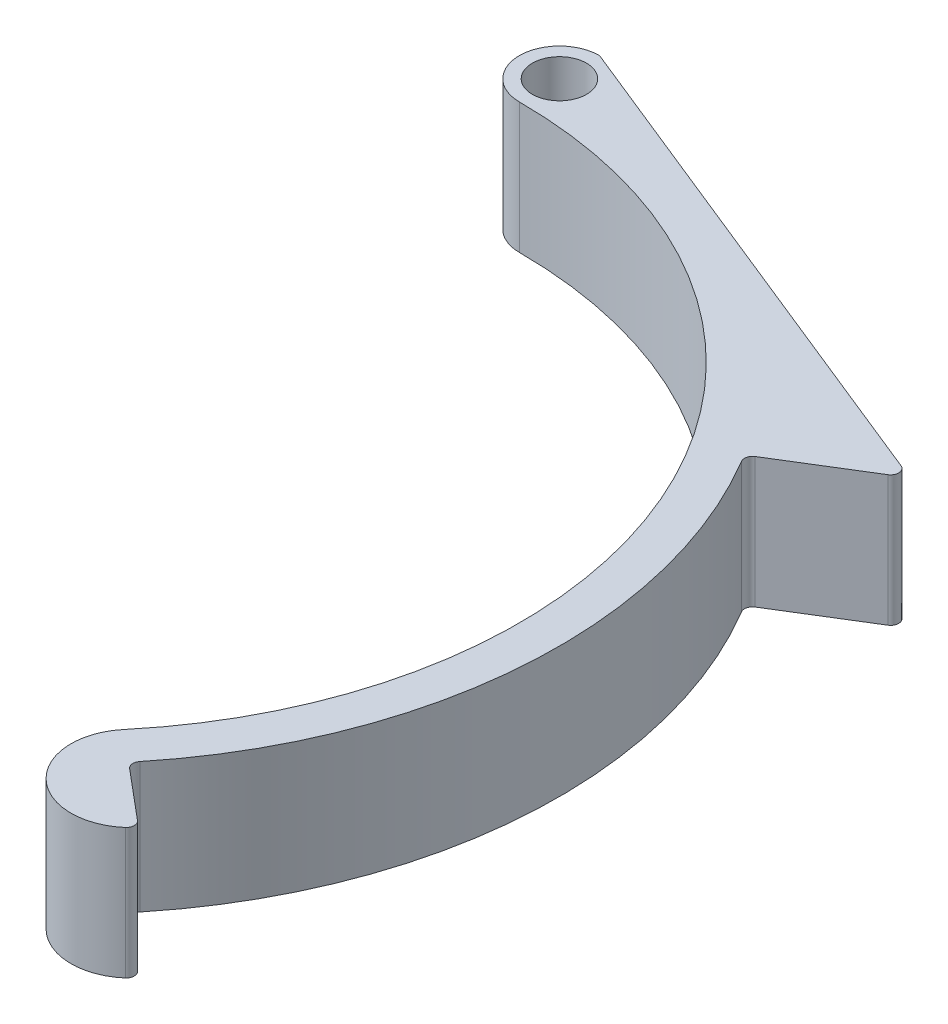
ISO-10303-21;
HEADER;
FILE_DESCRIPTION(('STEP AP214'),'2;1');
FILE_NAME('part.step','',(''),(''),'','','');
FILE_SCHEMA(('AUTOMOTIVE_DESIGN { 1 0 10303 214 1 1 1 1 }'));
ENDSEC;
DATA;
#1=APPLICATION_CONTEXT('core data for automotive mechanical design processes');
#2=APPLICATION_PROTOCOL_DEFINITION('international standard','automotive_design',2000,#1);
#3=PRODUCT_CONTEXT('',#1,'mechanical');
#4=PRODUCT('Part','Part','',(#3));
#5=PRODUCT_RELATED_PRODUCT_CATEGORY('part','',(#4));
#6=PRODUCT_DEFINITION_FORMATION('','',#4);
#7=PRODUCT_DEFINITION_CONTEXT('part definition',#1,'design');
#8=PRODUCT_DEFINITION('design','',#6,#7);
#9=PRODUCT_DEFINITION_SHAPE('','',#8);
#10=(LENGTH_UNIT() NAMED_UNIT(*) SI_UNIT(.MILLI.,.METRE.));
#11=(NAMED_UNIT(*) PLANE_ANGLE_UNIT() SI_UNIT($,.RADIAN.));
#12=(NAMED_UNIT(*) SI_UNIT($,.STERADIAN.) SOLID_ANGLE_UNIT());
#13=UNCERTAINTY_MEASURE_WITH_UNIT(LENGTH_MEASURE(1.E-05),#10,'distance_accuracy_value','');
#14=(GEOMETRIC_REPRESENTATION_CONTEXT(3) GLOBAL_UNCERTAINTY_ASSIGNED_CONTEXT((#13)) GLOBAL_UNIT_ASSIGNED_CONTEXT((#10,
#11,#12)) REPRESENTATION_CONTEXT('',''));
#15=CARTESIAN_POINT('',(0.,0.,0.));
#16=DIRECTION('',(0.,0.,1.));
#17=DIRECTION('',(1.,0.,0.));
#18=AXIS2_PLACEMENT_3D('',#15,#16,#17);
#19=CARTESIAN_POINT('',(0.,13.,0.));
#20=DIRECTION('',(0.,-1.,0.));
#21=DIRECTION('',(0.,0.,-1.));
#22=AXIS2_PLACEMENT_3D('',#19,#20,#21);
#23=CYLINDRICAL_SURFACE('',#22,45.);
#24=CARTESIAN_POINT('',(0.,0.,0.));
#25=DIRECTION('',(0.,1.,0.));
#26=DIRECTION('',(0.,0.,1.));
#27=AXIS2_PLACEMENT_3D('',#24,#25,#26);
#28=CIRCLE('',#27,45.);
#29=CARTESIAN_POINT('',(0.,0.,-45.));
#30=VERTEX_POINT('',#29);
#31=CARTESIAN_POINT('',(34.4719999403541,0.,28.9254424358942));
#32=VERTEX_POINT('',#31);
#33=EDGE_CURVE('E158',#30,#32,#28,.F.);
#34=ORIENTED_EDGE('',*,*,#33,.T.);
#35=DIRECTION('',(0.,-1.,0.));
#36=VECTOR('',#35,1.);
#37=CARTESIAN_POINT('',(34.4719999403541,13.,28.9254424358942));
#38=LINE('',#37,#36);
#39=CARTESIAN_POINT('',(34.4719999403541,13.,28.9254424358942));
#40=VERTEX_POINT('',#39);
#41=EDGE_CURVE('E141',#40,#32,#38,.T.);
#42=ORIENTED_EDGE('',*,*,#41,.F.);
#43=CARTESIAN_POINT('',(0.,13.,0.));
#44=DIRECTION('',(0.,1.,0.));
#45=DIRECTION('',(0.,0.,1.));
#46=AXIS2_PLACEMENT_3D('',#43,#44,#45);
#47=CIRCLE('',#46,45.);
#48=CARTESIAN_POINT('',(0.,13.,-45.));
#49=VERTEX_POINT('',#48);
#50=EDGE_CURVE('E148',#49,#40,#47,.F.);
#51=ORIENTED_EDGE('',*,*,#50,.F.);
#52=DIRECTION('',(0.,-1.,0.));
#53=VECTOR('',#52,1.);
#54=CARTESIAN_POINT('',(0.,13.,-45.));
#55=LINE('',#54,#53);
#56=EDGE_CURVE('E161',#49,#30,#55,.T.);
#57=ORIENTED_EDGE('',*,*,#56,.T.);
#58=EDGE_LOOP('',(#34,#42,#51,#57));
#59=FACE_BOUND('',#58,.T.);
#60=ADVANCED_FACE('F45',(#59),#23,.F.);
#61=CARTESIAN_POINT('',(39.0682665990679,13.,32.7821680940134));
#62=DIRECTION('',(0.,-1.,0.));
#63=DIRECTION('',(0.,0.,-1.));
#64=AXIS2_PLACEMENT_3D('',#61,#62,#63);
#65=CYLINDRICAL_SURFACE('',#64,6.);
#66=CARTESIAN_POINT('',(39.0682665990679,0.,32.7821680940134));
#67=DIRECTION('',(0.,1.,0.));
#68=DIRECTION('',(0.,0.,1.));
#69=AXIS2_PLACEMENT_3D('',#66,#67,#68);
#70=CIRCLE('',#69,6.);
#71=CARTESIAN_POINT('',(43.0164714381837,0.,37.3000966623269));
#72=VERTEX_POINT('',#71);
#73=EDGE_CURVE('E266',#32,#72,#70,.T.);
#74=ORIENTED_EDGE('',*,*,#73,.T.);
#75=DIRECTION('',(0.,-1.,0.));
#76=VECTOR('',#75,1.);
#77=CARTESIAN_POINT('',(43.0164714381837,13.,37.3000966623269));
#78=LINE('',#77,#76);
#79=CARTESIAN_POINT('',(43.0164714381837,13.,37.3000966623269));
#80=VERTEX_POINT('',#79);
#81=EDGE_CURVE('E144',#72,#80,#78,.F.);
#82=ORIENTED_EDGE('',*,*,#81,.T.);
#83=CARTESIAN_POINT('',(39.0682665990679,13.,32.7821680940134));
#84=DIRECTION('',(0.,1.,0.));
#85=DIRECTION('',(0.,0.,1.));
#86=AXIS2_PLACEMENT_3D('',#83,#84,#85);
#87=CIRCLE('',#86,6.);
#88=EDGE_CURVE('E136',#40,#80,#87,.T.);
#89=ORIENTED_EDGE('',*,*,#88,.F.);
#90=ORIENTED_EDGE('',*,*,#41,.T.);
#91=EDGE_LOOP('',(#74,#82,#89,#90));
#92=FACE_BOUND('',#91,.T.);
#93=ADVANCED_FACE('F139',(#92),#65,.T.);
#94=CARTESIAN_POINT('',(0.,13.,0.));
#95=DIRECTION('',(-0.642787609686538,0.,0.766044443118979));
#96=DIRECTION('',(0.766044443118979,0.,0.642787609686538));
#97=AXIS2_PLACEMENT_3D('',#94,#95,#96);
#98=PLANE('',#97);
#99=DIRECTION('',(-0.766044443118979,0.,-0.642787609686538));
#100=VECTOR('',#99,1.);
#101=CARTESIAN_POINT('',(0.,13.,0.));
#102=LINE('',#101,#100);
#103=CARTESIAN_POINT('',(43.0042742140509,13.,36.0848706320566));
#104=VERTEX_POINT('',#103);
#105=CARTESIAN_POINT('',(38.1440905757851,13.,32.0066923337339));
#106=VERTEX_POINT('',#105);
#107=EDGE_CURVE('E147',#104,#106,#102,.T.);
#108=ORIENTED_EDGE('',*,*,#107,.F.);
#109=DIRECTION('',(0.,-1.,0.));
#110=VECTOR('',#109,1.);
#111=CARTESIAN_POINT('',(43.0042742140509,13.,36.0848706320566));
#112=LINE('',#111,#110);
#113=CARTESIAN_POINT('',(43.0042742140509,0.,36.0848706320566));
#114=VERTEX_POINT('',#113);
#115=EDGE_CURVE('E165',#104,#114,#112,.T.);
#116=ORIENTED_EDGE('',*,*,#115,.T.);
#117=DIRECTION('',(-0.766044443118979,0.,-0.642787609686538));
#118=VECTOR('',#117,1.);
#119=CARTESIAN_POINT('',(0.,0.,0.));
#120=LINE('',#119,#118);
#121=CARTESIAN_POINT('',(38.1440905757851,0.,32.0066923337339));
#122=VERTEX_POINT('',#121);
#123=EDGE_CURVE('E240',#114,#122,#120,.T.);
#124=ORIENTED_EDGE('',*,*,#123,.T.);
#125=DIRECTION('',(0.,1.,0.));
#126=VECTOR('',#125,1.);
#127=CARTESIAN_POINT('',(38.1440905757851,13.,32.0066923337339));
#128=LINE('',#127,#126);
#129=EDGE_CURVE('E160',#122,#106,#128,.T.);
#130=ORIENTED_EDGE('',*,*,#129,.T.);
#131=EDGE_LOOP('',(#108,#116,#124,#130));
#132=FACE_BOUND('',#131,.T.);
#133=ADVANCED_FACE('F295',(#132),#98,.F.);
#134=CARTESIAN_POINT('',(0.,13.,0.));
#135=DIRECTION('',(0.,-1.,0.));
#136=DIRECTION('',(0.,0.,-1.));
#137=AXIS2_PLACEMENT_3D('',#134,#135,#136);
#138=CYLINDRICAL_SURFACE('',#137,49.);
#139=CARTESIAN_POINT('',(0.,13.,0.));
#140=DIRECTION('',(0.,1.,0.));
#141=DIRECTION('',(0.,0.,1.));
#142=AXIS2_PLACEMENT_3D('',#139,#140,#141);
#143=CIRCLE('',#142,49.);
#144=CARTESIAN_POINT('',(38.0373034641201,13.,30.8895377948333));
#145=VERTEX_POINT('',#144);
#146=CARTESIAN_POINT('',(42.1148392112088,13.,-25.0467626294103));
#147=VERTEX_POINT('',#146);
#148=EDGE_CURVE('E245',#145,#147,#143,.T.);
#149=ORIENTED_EDGE('',*,*,#148,.F.);
#150=DIRECTION('',(0.,-1.,0.));
#151=VECTOR('',#150,1.);
#152=CARTESIAN_POINT('',(38.0373034641201,13.,30.8895377948333));
#153=LINE('',#152,#151);
#154=CARTESIAN_POINT('',(38.0373034641201,0.,30.8895377948333));
#155=VERTEX_POINT('',#154);
#156=EDGE_CURVE('E194',#145,#155,#153,.T.);
#157=ORIENTED_EDGE('',*,*,#156,.T.);
#158=CARTESIAN_POINT('',(0.,0.,0.));
#159=DIRECTION('',(0.,1.,0.));
#160=DIRECTION('',(0.,0.,1.));
#161=AXIS2_PLACEMENT_3D('',#158,#159,#160);
#162=CIRCLE('',#161,49.);
#163=CARTESIAN_POINT('',(42.1148392112088,0.,-25.0467626294103));
#164=VERTEX_POINT('',#163);
#165=EDGE_CURVE('E228',#155,#164,#162,.T.);
#166=ORIENTED_EDGE('',*,*,#165,.T.);
#167=DIRECTION('',(0.,-1.,0.));
#168=VECTOR('',#167,1.);
#169=CARTESIAN_POINT('',(42.1148392112088,13.,-25.0467626294103));
#170=LINE('',#169,#168);
#171=EDGE_CURVE('E191',#164,#147,#170,.F.);
#172=ORIENTED_EDGE('',*,*,#171,.T.);
#173=EDGE_LOOP('',(#149,#157,#166,#172));
#174=FACE_BOUND('',#173,.T.);
#175=ADVANCED_FACE('F236',(#174),#138,.T.);
#176=CARTESIAN_POINT('',(0.,13.,0.));
#177=DIRECTION('',(0.524899474172595,0.,0.851164227404637));
#178=DIRECTION('',(0.851164227404637,0.,-0.524899474172595));
#179=AXIS2_PLACEMENT_3D('',#176,#177,#178);
#180=PLANE('',#179);
#181=DIRECTION('',(-0.851164227404637,0.,0.524899474172595));
#182=VECTOR('',#181,1.);
#183=CARTESIAN_POINT('',(0.,0.,0.));
#184=LINE('',#183,#182);
#185=CARTESIAN_POINT('',(50.5748997151719,0.,-31.1887382153871));
#186=VERTEX_POINT('',#185);
#187=CARTESIAN_POINT('',(42.3825088434823,0.,-26.1366207481407));
#188=VERTEX_POINT('',#187);
#189=EDGE_CURVE('E230',#186,#188,#184,.T.);
#190=ORIENTED_EDGE('',*,*,#189,.F.);
#191=DIRECTION('',(0.,-1.,0.));
#192=VECTOR('',#191,1.);
#193=CARTESIAN_POINT('',(50.5748997151719,13.,-31.1887382153871));
#194=LINE('',#193,#192);
#195=CARTESIAN_POINT('',(50.5748997151719,13.,-31.1887382153871));
#196=VERTEX_POINT('',#195);
#197=EDGE_CURVE('E213',#186,#196,#194,.F.);
#198=ORIENTED_EDGE('',*,*,#197,.T.);
#199=DIRECTION('',(-0.851164227404637,0.,0.524899474172595));
#200=VECTOR('',#199,1.);
#201=CARTESIAN_POINT('',(0.,13.,0.));
#202=LINE('',#201,#200);
#203=CARTESIAN_POINT('',(42.3825088434823,13.,-26.1366207481407));
#204=VERTEX_POINT('',#203);
#205=EDGE_CURVE('E244',#196,#204,#202,.T.);
#206=ORIENTED_EDGE('',*,*,#205,.T.);
#207=DIRECTION('',(0.,-1.,0.));
#208=VECTOR('',#207,1.);
#209=CARTESIAN_POINT('',(42.3825088434823,13.,-26.1366207481407));
#210=LINE('',#209,#208);
#211=EDGE_CURVE('E209',#204,#188,#210,.T.);
#212=ORIENTED_EDGE('',*,*,#211,.T.);
#213=EDGE_LOOP('',(#190,#198,#206,#212));
#214=FACE_BOUND('',#213,.T.);
#215=ADVANCED_FACE('F247',(#214),#180,.T.);
#216=CARTESIAN_POINT('',(18.4107690922549,13.,-45.5602618405853));
#217=DIRECTION('',(0.374663072776281,0.,-0.927161033422908));
#218=DIRECTION('',(-0.927161033422908,0.,-0.374663072776281));
#219=AXIS2_PLACEMENT_3D('',#216,#217,#218);
#220=PLANE('',#219);
#221=DIRECTION('',(0.927161033422908,0.,0.374663072776281));
#222=VECTOR('',#221,1.);
#223=CARTESIAN_POINT('',(18.4107690922549,0.,-45.5602618405853));
#224=LINE('',#223,#222);
#225=CARTESIAN_POINT('',(0.152578115339287,0.,-52.938343628053));
#226=VERTEX_POINT('',#225);
#227=CARTESIAN_POINT('',(50.4547105940548,0.,-32.6113984240491));
#228=VERTEX_POINT('',#227);
#229=EDGE_CURVE('E274',#226,#228,#224,.T.);
#230=ORIENTED_EDGE('',*,*,#229,.F.);
#231=DIRECTION('',(0.,-1.,0.));
#232=VECTOR('',#231,1.);
#233=CARTESIAN_POINT('',(0.152578115339284,13.,-52.938343628053));
#234=LINE('',#233,#232);
#235=CARTESIAN_POINT('',(0.152578115339287,13.,-52.938343628053));
#236=VERTEX_POINT('',#235);
#237=EDGE_CURVE('E206',#226,#236,#234,.F.);
#238=ORIENTED_EDGE('',*,*,#237,.T.);
#239=DIRECTION('',(0.927161033422908,0.,0.374663072776281));
#240=VECTOR('',#239,1.);
#241=CARTESIAN_POINT('',(18.4107690922549,13.,-45.5602618405853));
#242=LINE('',#241,#240);
#243=CARTESIAN_POINT('',(50.4547105940548,13.,-32.6113984240491));
#244=VERTEX_POINT('',#243);
#245=EDGE_CURVE('E250',#236,#244,#242,.T.);
#246=ORIENTED_EDGE('',*,*,#245,.T.);
#247=DIRECTION('',(0.,-1.,0.));
#248=VECTOR('',#247,1.);
#249=CARTESIAN_POINT('',(50.4547105940548,13.,-32.6113984240491));
#250=LINE('',#249,#248);
#251=EDGE_CURVE('E202',#244,#228,#250,.T.);
#252=ORIENTED_EDGE('',*,*,#251,.T.);
#253=EDGE_LOOP('',(#230,#238,#246,#252));
#254=FACE_BOUND('',#253,.T.);
#255=ADVANCED_FACE('F306',(#254),#220,.T.);
#256=CARTESIAN_POINT('',(0.,13.,-49.));
#257=DIRECTION('',(0.,-1.,0.));
#258=DIRECTION('',(0.,0.,-1.));
#259=AXIS2_PLACEMENT_3D('',#256,#257,#258);
#260=CYLINDRICAL_SURFACE('',#259,2.7);
#261=CARTESIAN_POINT('',(0.,13.,-49.));
#262=DIRECTION('',(0.,1.,0.));
#263=DIRECTION('',(0.,0.,1.));
#264=AXIS2_PLACEMENT_3D('',#261,#262,#263);
#265=CIRCLE('',#264,2.7);
#266=CARTESIAN_POINT('',(0.,13.,-46.3));
#267=VERTEX_POINT('',#266);
#268=EDGE_CURVE('E155',#267,#267,#265,.T.);
#269=ORIENTED_EDGE('',*,*,#268,.T.);
#270=EDGE_LOOP('',(#269));
#271=FACE_BOUND('',#270,.T.);
#272=CARTESIAN_POINT('',(0.,0.,-49.));
#273=DIRECTION('',(0.,1.,0.));
#274=DIRECTION('',(0.,0.,1.));
#275=AXIS2_PLACEMENT_3D('',#272,#273,#274);
#276=CIRCLE('',#275,2.7);
#277=CARTESIAN_POINT('',(0.,0.,-46.3));
#278=VERTEX_POINT('',#277);
#279=EDGE_CURVE('E260',#278,#278,#276,.T.);
#280=ORIENTED_EDGE('',*,*,#279,.F.);
#281=EDGE_LOOP('',(#280));
#282=FACE_BOUND('',#281,.T.);
#283=ADVANCED_FACE('F324',(#271,#282),#260,.F.);
#284=CARTESIAN_POINT('',(0.,13.,-49.));
#285=DIRECTION('',(0.,-1.,0.));
#286=DIRECTION('',(0.,0.,-1.));
#287=AXIS2_PLACEMENT_3D('',#284,#285,#286);
#288=CYLINDRICAL_SURFACE('',#287,4.);
#289=CARTESIAN_POINT('',(0.,13.,-49.));
#290=DIRECTION('',(0.,1.,0.));
#291=DIRECTION('',(0.,0.,1.));
#292=AXIS2_PLACEMENT_3D('',#289,#290,#291);
#293=CIRCLE('',#292,4.);
#294=CARTESIAN_POINT('',(-0.183940428602176,13.,-52.9957685016434));
#295=VERTEX_POINT('',#294);
#296=EDGE_CURVE('E152',#49,#295,#293,.F.);
#297=ORIENTED_EDGE('',*,*,#296,.T.);
#298=DIRECTION('',(0.,-1.,0.));
#299=VECTOR('',#298,1.);
#300=CARTESIAN_POINT('',(-0.183940428602176,13.,-52.9957685016434));
#301=LINE('',#300,#299);
#302=CARTESIAN_POINT('',(-0.183940428602176,0.,-52.9957685016434));
#303=VERTEX_POINT('',#302);
#304=EDGE_CURVE('E198',#295,#303,#301,.T.);
#305=ORIENTED_EDGE('',*,*,#304,.T.);
#306=CARTESIAN_POINT('',(0.,0.,-49.));
#307=DIRECTION('',(0.,1.,0.));
#308=DIRECTION('',(0.,0.,1.));
#309=AXIS2_PLACEMENT_3D('',#306,#307,#308);
#310=CIRCLE('',#309,4.);
#311=EDGE_CURVE('E277',#30,#303,#310,.F.);
#312=ORIENTED_EDGE('',*,*,#311,.F.);
#313=ORIENTED_EDGE('',*,*,#56,.F.);
#314=EDGE_LOOP('',(#297,#305,#312,#313));
#315=FACE_BOUND('',#314,.T.);
#316=ADVANCED_FACE('F299',(#315),#288,.T.);
#317=CARTESIAN_POINT('',(0.,13.,0.));
#318=DIRECTION('',(0.,1.,0.));
#319=DIRECTION('',(0.,0.,1.));
#320=AXIS2_PLACEMENT_3D('',#317,#318,#319);
#321=PLANE('',#320);
#322=ORIENTED_EDGE('',*,*,#268,.F.);
#323=EDGE_LOOP('',(#322));
#324=FACE_BOUND('',#323,.T.);
#325=ORIENTED_EDGE('',*,*,#88,.T.);
#326=CARTESIAN_POINT('',(42.4900441263016,13.,36.6977061865517));
#327=DIRECTION('',(0.,1.,0.));
#328=DIRECTION('',(0.,0.,1.));
#329=AXIS2_PLACEMENT_3D('',#326,#327,#328);
#330=CIRCLE('',#329,0.8);
#331=EDGE_CURVE('E188',#80,#104,#330,.T.);
#332=ORIENTED_EDGE('',*,*,#331,.T.);
#333=ORIENTED_EDGE('',*,*,#107,.T.);
#334=CARTESIAN_POINT('',(38.6583206635343,13.,31.3938567792387));
#335=DIRECTION('',(0.,1.,0.));
#336=DIRECTION('',(0.,0.,1.));
#337=AXIS2_PLACEMENT_3D('',#334,#335,#336);
#338=CIRCLE('',#337,0.8);
#339=EDGE_CURVE('E219',#106,#145,#338,.F.);
#340=ORIENTED_EDGE('',*,*,#339,.T.);
#341=ORIENTED_EDGE('',*,*,#148,.T.);
#342=CARTESIAN_POINT('',(42.8024284228204,13.,-25.455689366217));
#343=DIRECTION('',(0.,1.,0.));
#344=DIRECTION('',(0.,0.,1.));
#345=AXIS2_PLACEMENT_3D('',#342,#343,#344);
#346=CIRCLE('',#345,0.8);
#347=EDGE_CURVE('E11',#147,#204,#346,.F.);
#348=ORIENTED_EDGE('',*,*,#347,.T.);
#349=ORIENTED_EDGE('',*,*,#205,.F.);
#350=CARTESIAN_POINT('',(50.1549801358338,13.,-31.8696695973108));
#351=DIRECTION('',(0.,1.,0.));
#352=DIRECTION('',(0.,0.,1.));
#353=AXIS2_PLACEMENT_3D('',#350,#351,#352);
#354=CIRCLE('',#353,0.8);
#355=EDGE_CURVE('E67',#196,#244,#354,.T.);
#356=ORIENTED_EDGE('',*,*,#355,.T.);
#357=ORIENTED_EDGE('',*,*,#245,.F.);
#358=CARTESIAN_POINT('',(-0.147152342881741,13.,-52.1966148013147));
#359=DIRECTION('',(0.,1.,0.));
#360=DIRECTION('',(0.,0.,1.));
#361=AXIS2_PLACEMENT_3D('',#358,#359,#360);
#362=CIRCLE('',#361,0.8);
#363=EDGE_CURVE('E61',#236,#295,#362,.T.);
#364=ORIENTED_EDGE('',*,*,#363,.T.);
#365=ORIENTED_EDGE('',*,*,#296,.F.);
#366=ORIENTED_EDGE('',*,*,#50,.T.);
#367=EDGE_LOOP('',(#325,#332,#333,#340,#341,#348,#349,#356,#357,#364,#365,#366));
#368=FACE_BOUND('',#367,.T.);
#369=ADVANCED_FACE('F151',(#324,#368),#321,.T.);
#370=CARTESIAN_POINT('',(0.,0.,0.));
#371=DIRECTION('',(0.,1.,0.));
#372=DIRECTION('',(0.,0.,1.));
#373=AXIS2_PLACEMENT_3D('',#370,#371,#372);
#374=PLANE('',#373);
#375=ORIENTED_EDGE('',*,*,#279,.T.);
#376=EDGE_LOOP('',(#375));
#377=FACE_BOUND('',#376,.T.);
#378=ORIENTED_EDGE('',*,*,#123,.F.);
#379=CARTESIAN_POINT('',(42.4900441263016,0.,36.6977061865517));
#380=DIRECTION('',(0.,1.,0.));
#381=DIRECTION('',(0.,0.,1.));
#382=AXIS2_PLACEMENT_3D('',#379,#380,#381);
#383=CIRCLE('',#382,0.8);
#384=EDGE_CURVE('E179',#114,#72,#383,.F.);
#385=ORIENTED_EDGE('',*,*,#384,.T.);
#386=ORIENTED_EDGE('',*,*,#73,.F.);
#387=ORIENTED_EDGE('',*,*,#33,.F.);
#388=ORIENTED_EDGE('',*,*,#311,.T.);
#389=CARTESIAN_POINT('',(-0.147152342881741,0.,-52.1966148013147));
#390=DIRECTION('',(0.,1.,0.));
#391=DIRECTION('',(0.,0.,1.));
#392=AXIS2_PLACEMENT_3D('',#389,#390,#391);
#393=CIRCLE('',#392,0.8);
#394=EDGE_CURVE('E176',#303,#226,#393,.F.);
#395=ORIENTED_EDGE('',*,*,#394,.T.);
#396=ORIENTED_EDGE('',*,*,#229,.T.);
#397=CARTESIAN_POINT('',(50.1549801358338,0.,-31.8696695973108));
#398=DIRECTION('',(0.,1.,0.));
#399=DIRECTION('',(0.,0.,1.));
#400=AXIS2_PLACEMENT_3D('',#397,#398,#399);
#401=CIRCLE('',#400,0.8);
#402=EDGE_CURVE('E173',#228,#186,#401,.F.);
#403=ORIENTED_EDGE('',*,*,#402,.T.);
#404=ORIENTED_EDGE('',*,*,#189,.T.);
#405=CARTESIAN_POINT('',(42.8024284228204,0.,-25.455689366217));
#406=DIRECTION('',(0.,1.,0.));
#407=DIRECTION('',(0.,0.,1.));
#408=AXIS2_PLACEMENT_3D('',#405,#406,#407);
#409=CIRCLE('',#408,0.8);
#410=EDGE_CURVE('E54',#188,#164,#409,.T.);
#411=ORIENTED_EDGE('',*,*,#410,.T.);
#412=ORIENTED_EDGE('',*,*,#165,.F.);
#413=CARTESIAN_POINT('',(38.6583206635343,0.,31.3938567792387));
#414=DIRECTION('',(0.,1.,0.));
#415=DIRECTION('',(0.,0.,1.));
#416=AXIS2_PLACEMENT_3D('',#413,#414,#415);
#417=CIRCLE('',#416,0.8);
#418=EDGE_CURVE('E216',#155,#122,#417,.T.);
#419=ORIENTED_EDGE('',*,*,#418,.T.);
#420=EDGE_LOOP('',(#378,#385,#386,#387,#388,#395,#396,#403,#404,#411,#412,#419));
#421=FACE_BOUND('',#420,.T.);
#422=ADVANCED_FACE('F227',(#377,#421),#374,.F.);
#423=CARTESIAN_POINT('',(42.4900441263016,13.,36.6977061865517));
#424=DIRECTION('',(0.,-1.,0.));
#425=DIRECTION('',(0.,0.,-1.));
#426=AXIS2_PLACEMENT_3D('',#423,#424,#425);
#427=CYLINDRICAL_SURFACE('',#426,0.8);
#428=ORIENTED_EDGE('',*,*,#331,.F.);
#429=ORIENTED_EDGE('',*,*,#81,.F.);
#430=ORIENTED_EDGE('',*,*,#384,.F.);
#431=ORIENTED_EDGE('',*,*,#115,.F.);
#432=EDGE_LOOP('',(#428,#429,#430,#431));
#433=FACE_BOUND('',#432,.T.);
#434=ADVANCED_FACE('F297',(#433),#427,.T.);
#435=CARTESIAN_POINT('',(38.6583206635343,13.,31.3938567792387));
#436=DIRECTION('',(0.,-1.,0.));
#437=DIRECTION('',(0.,0.,-1.));
#438=AXIS2_PLACEMENT_3D('',#435,#436,#437);
#439=CYLINDRICAL_SURFACE('',#438,0.8);
#440=ORIENTED_EDGE('',*,*,#339,.F.);
#441=ORIENTED_EDGE('',*,*,#129,.F.);
#442=ORIENTED_EDGE('',*,*,#418,.F.);
#443=ORIENTED_EDGE('',*,*,#156,.F.);
#444=EDGE_LOOP('',(#440,#441,#442,#443));
#445=FACE_BOUND('',#444,.T.);
#446=ADVANCED_FACE('F294',(#445),#439,.F.);
#447=CARTESIAN_POINT('',(-0.147152342881741,13.,-52.1966148013147));
#448=DIRECTION('',(0.,-1.,0.));
#449=DIRECTION('',(0.,0.,-1.));
#450=AXIS2_PLACEMENT_3D('',#447,#448,#449);
#451=CYLINDRICAL_SURFACE('',#450,0.8);
#452=ORIENTED_EDGE('',*,*,#363,.F.);
#453=ORIENTED_EDGE('',*,*,#237,.F.);
#454=ORIENTED_EDGE('',*,*,#394,.F.);
#455=ORIENTED_EDGE('',*,*,#304,.F.);
#456=EDGE_LOOP('',(#452,#453,#454,#455));
#457=FACE_BOUND('',#456,.T.);
#458=ADVANCED_FACE('F302',(#457),#451,.T.);
#459=CARTESIAN_POINT('',(50.1549801358338,13.,-31.8696695973108));
#460=DIRECTION('',(0.,-1.,0.));
#461=DIRECTION('',(0.,0.,-1.));
#462=AXIS2_PLACEMENT_3D('',#459,#460,#461);
#463=CYLINDRICAL_SURFACE('',#462,0.8);
#464=ORIENTED_EDGE('',*,*,#355,.F.);
#465=ORIENTED_EDGE('',*,*,#197,.F.);
#466=ORIENTED_EDGE('',*,*,#402,.F.);
#467=ORIENTED_EDGE('',*,*,#251,.F.);
#468=EDGE_LOOP('',(#464,#465,#466,#467));
#469=FACE_BOUND('',#468,.T.);
#470=ADVANCED_FACE('F309',(#469),#463,.T.);
#471=CARTESIAN_POINT('',(42.8024284228204,13.,-25.455689366217));
#472=DIRECTION('',(0.,-1.,0.));
#473=DIRECTION('',(0.,0.,-1.));
#474=AXIS2_PLACEMENT_3D('',#471,#472,#473);
#475=CYLINDRICAL_SURFACE('',#474,0.8);
#476=ORIENTED_EDGE('',*,*,#347,.F.);
#477=ORIENTED_EDGE('',*,*,#171,.F.);
#478=ORIENTED_EDGE('',*,*,#410,.F.);
#479=ORIENTED_EDGE('',*,*,#211,.F.);
#480=EDGE_LOOP('',(#476,#477,#478,#479));
#481=FACE_BOUND('',#480,.T.);
#482=ADVANCED_FACE('F47',(#481),#475,.F.);
#483=CLOSED_SHELL('',(#60,#93,#133,#175,#215,#255,#283,#316,#369,#422,#434,#446,#458,#470,#482));
#484=MANIFOLD_SOLID_BREP('B2',#483);
#485=ADVANCED_BREP_SHAPE_REPRESENTATION('',(#18,#484),#14);
#486=SHAPE_DEFINITION_REPRESENTATION(#9,#485);
ENDSEC;
END-ISO-10303-21;
